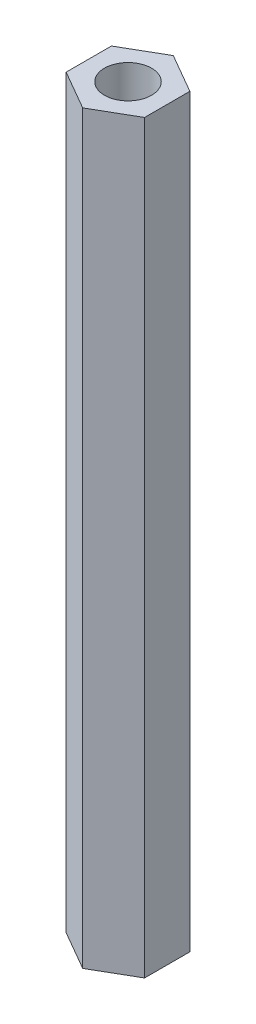
ISO-10303-21;
HEADER;
FILE_DESCRIPTION(('STEP AP214'),'2;1');
FILE_NAME('part.step','',(''),(''),'','','');
FILE_SCHEMA(('AUTOMOTIVE_DESIGN { 1 0 10303 214 1 1 1 1 }'));
ENDSEC;
DATA;
#1=APPLICATION_CONTEXT('core data for automotive mechanical design processes');
#2=APPLICATION_PROTOCOL_DEFINITION('international standard','automotive_design',2000,#1);
#3=PRODUCT_CONTEXT('',#1,'mechanical');
#4=PRODUCT('Part','Part','',(#3));
#5=PRODUCT_RELATED_PRODUCT_CATEGORY('part','',(#4));
#6=PRODUCT_DEFINITION_FORMATION('','',#4);
#7=PRODUCT_DEFINITION_CONTEXT('part definition',#1,'design');
#8=PRODUCT_DEFINITION('design','',#6,#7);
#9=PRODUCT_DEFINITION_SHAPE('','',#8);
#10=(LENGTH_UNIT() NAMED_UNIT(*) SI_UNIT(.MILLI.,.METRE.));
#11=(NAMED_UNIT(*) PLANE_ANGLE_UNIT() SI_UNIT($,.RADIAN.));
#12=(NAMED_UNIT(*) SI_UNIT($,.STERADIAN.) SOLID_ANGLE_UNIT());
#13=UNCERTAINTY_MEASURE_WITH_UNIT(LENGTH_MEASURE(1.E-05),#10,'distance_accuracy_value','');
#14=(GEOMETRIC_REPRESENTATION_CONTEXT(3) GLOBAL_UNCERTAINTY_ASSIGNED_CONTEXT((#13)) GLOBAL_UNIT_ASSIGNED_CONTEXT((#10,
#11,#12)) REPRESENTATION_CONTEXT('',''));
#15=CARTESIAN_POINT('',(0.,0.,0.));
#16=DIRECTION('',(0.,0.,1.));
#17=DIRECTION('',(1.,0.,0.));
#18=AXIS2_PLACEMENT_3D('',#15,#16,#17);
#19=CARTESIAN_POINT('',(0.,47.5,0.));
#20=DIRECTION('',(0.,1.,0.));
#21=DIRECTION('',(0.,0.,1.));
#22=AXIS2_PLACEMENT_3D('',#19,#20,#21);
#23=PLANE('',#22);
#24=DIRECTION('',(0.866025403784442,0.,0.499999999999995));
#25=VECTOR('',#24,1.);
#26=CARTESIAN_POINT('',(-2.49999999999999,47.5,1.44337567297409));
#27=LINE('',#26,#25);
#28=CARTESIAN_POINT('',(-2.49999999999999,47.5,1.44337567297409));
#29=VERTEX_POINT('',#28);
#30=CARTESIAN_POINT('',(0.,47.5,2.88675134594813));
#31=VERTEX_POINT('',#30);
#32=EDGE_CURVE('E131',#29,#31,#27,.T.);
#33=ORIENTED_EDGE('',*,*,#32,.T.);
#34=DIRECTION('',(0.866025403784438,0.,-0.500000000000001));
#35=VECTOR('',#34,1.);
#36=CARTESIAN_POINT('',(0.,47.5,2.88675134594813));
#37=LINE('',#36,#35);
#38=CARTESIAN_POINT('',(2.50000000000001,47.5,1.44337567297406));
#39=VERTEX_POINT('',#38);
#40=EDGE_CURVE('E89',#31,#39,#37,.T.);
#41=ORIENTED_EDGE('',*,*,#40,.T.);
#42=DIRECTION('',(0.,0.,-1.));
#43=VECTOR('',#42,1.);
#44=CARTESIAN_POINT('',(2.50000000000001,47.5,1.44337567297406));
#45=LINE('',#44,#43);
#46=CARTESIAN_POINT('',(2.5,47.5,-1.44337567297408));
#47=VERTEX_POINT('',#46);
#48=EDGE_CURVE('E102',#39,#47,#45,.T.);
#49=ORIENTED_EDGE('',*,*,#48,.T.);
#50=DIRECTION('',(-0.866025403784441,0.,-0.499999999999995));
#51=VECTOR('',#50,1.);
#52=CARTESIAN_POINT('',(2.5,47.5,-1.44337567297408));
#53=LINE('',#52,#51);
#54=CARTESIAN_POINT('',(0.,47.5,-2.88675134594813));
#55=VERTEX_POINT('',#54);
#56=EDGE_CURVE('E96',#47,#55,#53,.T.);
#57=ORIENTED_EDGE('',*,*,#56,.T.);
#58=DIRECTION('',(-0.866025403784435,0.,0.500000000000007));
#59=VECTOR('',#58,1.);
#60=CARTESIAN_POINT('',(0.,47.5,-2.88675134594813));
#61=LINE('',#60,#59);
#62=CARTESIAN_POINT('',(-2.50000000000002,47.5,-1.44337567297404));
#63=VERTEX_POINT('',#62);
#64=EDGE_CURVE('E100',#55,#63,#61,.T.);
#65=ORIENTED_EDGE('',*,*,#64,.T.);
#66=DIRECTION('',(0.,0.,1.));
#67=VECTOR('',#66,1.);
#68=CARTESIAN_POINT('',(-2.50000000000002,47.5,-1.44337567297404));
#69=LINE('',#68,#67);
#70=EDGE_CURVE('E52',#63,#29,#69,.T.);
#71=ORIENTED_EDGE('',*,*,#70,.T.);
#72=EDGE_LOOP('',(#33,#41,#49,#57,#65,#71));
#73=FACE_BOUND('',#72,.T.);
#74=CARTESIAN_POINT('',(0.,47.5,0.));
#75=DIRECTION('',(0.,1.,0.));
#76=DIRECTION('',(0.,0.,1.));
#77=AXIS2_PLACEMENT_3D('',#74,#75,#76);
#78=CIRCLE('',#77,1.5);
#79=CARTESIAN_POINT('',(0.,47.5,1.5));
#80=VERTEX_POINT('',#79);
#81=EDGE_CURVE('E124',#80,#80,#78,.T.);
#82=ORIENTED_EDGE('',*,*,#81,.F.);
#83=EDGE_LOOP('',(#82));
#84=FACE_BOUND('',#83,.T.);
#85=ADVANCED_FACE('F35',(#73,#84),#23,.T.);
#86=CARTESIAN_POINT('',(0.,0.,0.));
#87=DIRECTION('',(0.,1.,0.));
#88=DIRECTION('',(0.,0.,1.));
#89=AXIS2_PLACEMENT_3D('',#86,#87,#88);
#90=PLANE('',#89);
#91=DIRECTION('',(0.866025403784442,0.,0.499999999999995));
#92=VECTOR('',#91,1.);
#93=CARTESIAN_POINT('',(-2.49999999999999,0.,1.44337567297409));
#94=LINE('',#93,#92);
#95=CARTESIAN_POINT('',(-2.49999999999999,0.,1.44337567297409));
#96=VERTEX_POINT('',#95);
#97=CARTESIAN_POINT('',(0.,0.,2.88675134594813));
#98=VERTEX_POINT('',#97);
#99=EDGE_CURVE('E120',#96,#98,#94,.T.);
#100=ORIENTED_EDGE('',*,*,#99,.F.);
#101=DIRECTION('',(0.,0.,1.));
#102=VECTOR('',#101,1.);
#103=CARTESIAN_POINT('',(-2.50000000000002,0.,-1.44337567297404));
#104=LINE('',#103,#102);
#105=CARTESIAN_POINT('',(-2.50000000000002,0.,-1.44337567297404));
#106=VERTEX_POINT('',#105);
#107=EDGE_CURVE('E81',#106,#96,#104,.T.);
#108=ORIENTED_EDGE('',*,*,#107,.F.);
#109=DIRECTION('',(-0.866025403784435,0.,0.500000000000007));
#110=VECTOR('',#109,1.);
#111=CARTESIAN_POINT('',(0.,0.,-2.88675134594813));
#112=LINE('',#111,#110);
#113=CARTESIAN_POINT('',(0.,0.,-2.88675134594813));
#114=VERTEX_POINT('',#113);
#115=EDGE_CURVE('E75',#114,#106,#112,.T.);
#116=ORIENTED_EDGE('',*,*,#115,.F.);
#117=DIRECTION('',(-0.866025403784441,0.,-0.499999999999995));
#118=VECTOR('',#117,1.);
#119=CARTESIAN_POINT('',(2.5,0.,-1.44337567297408));
#120=LINE('',#119,#118);
#121=CARTESIAN_POINT('',(2.5,0.,-1.44337567297408));
#122=VERTEX_POINT('',#121);
#123=EDGE_CURVE('E110',#122,#114,#120,.T.);
#124=ORIENTED_EDGE('',*,*,#123,.F.);
#125=DIRECTION('',(0.,0.,-1.));
#126=VECTOR('',#125,1.);
#127=CARTESIAN_POINT('',(2.50000000000001,0.,1.44337567297406));
#128=LINE('',#127,#126);
#129=CARTESIAN_POINT('',(2.50000000000001,0.,1.44337567297406));
#130=VERTEX_POINT('',#129);
#131=EDGE_CURVE('E126',#130,#122,#128,.T.);
#132=ORIENTED_EDGE('',*,*,#131,.F.);
#133=DIRECTION('',(0.866025403784438,0.,-0.500000000000001));
#134=VECTOR('',#133,1.);
#135=CARTESIAN_POINT('',(0.,0.,2.88675134594813));
#136=LINE('',#135,#134);
#137=EDGE_CURVE('E123',#98,#130,#136,.T.);
#138=ORIENTED_EDGE('',*,*,#137,.F.);
#139=EDGE_LOOP('',(#100,#108,#116,#124,#132,#138));
#140=FACE_BOUND('',#139,.T.);
#141=CARTESIAN_POINT('',(0.,0.,0.));
#142=DIRECTION('',(0.,1.,0.));
#143=DIRECTION('',(0.,0.,1.));
#144=AXIS2_PLACEMENT_3D('',#141,#142,#143);
#145=CIRCLE('',#144,1.5);
#146=CARTESIAN_POINT('',(0.,0.,1.5));
#147=VERTEX_POINT('',#146);
#148=EDGE_CURVE('E224',#147,#147,#145,.T.);
#149=ORIENTED_EDGE('',*,*,#148,.T.);
#150=EDGE_LOOP('',(#149));
#151=FACE_BOUND('',#150,.T.);
#152=ADVANCED_FACE('F140',(#140,#151),#90,.F.);
#153=CARTESIAN_POINT('',(-2.49999999999999,47.5,1.44337567297409));
#154=DIRECTION('',(0.499999999999995,0.,-0.866025403784442));
#155=DIRECTION('',(-0.866025403784442,0.,-0.499999999999995));
#156=AXIS2_PLACEMENT_3D('',#153,#154,#155);
#157=PLANE('',#156);
#158=ORIENTED_EDGE('',*,*,#99,.T.);
#159=DIRECTION('',(0.,-1.,0.));
#160=VECTOR('',#159,1.);
#161=CARTESIAN_POINT('',(0.,47.5,2.88675134594813));
#162=LINE('',#161,#160);
#163=EDGE_CURVE('E11',#31,#98,#162,.T.);
#164=ORIENTED_EDGE('',*,*,#163,.F.);
#165=ORIENTED_EDGE('',*,*,#32,.F.);
#166=DIRECTION('',(0.,-1.,0.));
#167=VECTOR('',#166,1.);
#168=CARTESIAN_POINT('',(-2.49999999999999,47.5,1.44337567297409));
#169=LINE('',#168,#167);
#170=EDGE_CURVE('E116',#29,#96,#169,.T.);
#171=ORIENTED_EDGE('',*,*,#170,.T.);
#172=EDGE_LOOP('',(#158,#164,#165,#171));
#173=FACE_BOUND('',#172,.T.);
#174=ADVANCED_FACE('F37',(#173),#157,.F.);
#175=CARTESIAN_POINT('',(0.,47.5,2.88675134594813));
#176=DIRECTION('',(-0.500000000000001,0.,-0.866025403784438));
#177=DIRECTION('',(-0.866025403784438,0.,0.500000000000001));
#178=AXIS2_PLACEMENT_3D('',#175,#176,#177);
#179=PLANE('',#178);
#180=ORIENTED_EDGE('',*,*,#137,.T.);
#181=DIRECTION('',(0.,-1.,0.));
#182=VECTOR('',#181,1.);
#183=CARTESIAN_POINT('',(2.50000000000001,47.5,1.44337567297406));
#184=LINE('',#183,#182);
#185=EDGE_CURVE('E44',#39,#130,#184,.T.);
#186=ORIENTED_EDGE('',*,*,#185,.F.);
#187=ORIENTED_EDGE('',*,*,#40,.F.);
#188=ORIENTED_EDGE('',*,*,#163,.T.);
#189=EDGE_LOOP('',(#180,#186,#187,#188));
#190=FACE_BOUND('',#189,.T.);
#191=ADVANCED_FACE('F165',(#190),#179,.F.);
#192=CARTESIAN_POINT('',(2.50000000000001,47.5,1.44337567297406));
#193=DIRECTION('',(-1.,0.,0.));
#194=DIRECTION('',(0.,0.,1.));
#195=AXIS2_PLACEMENT_3D('',#192,#193,#194);
#196=PLANE('',#195);
#197=ORIENTED_EDGE('',*,*,#131,.T.);
#198=DIRECTION('',(0.,-1.,0.));
#199=VECTOR('',#198,1.);
#200=CARTESIAN_POINT('',(2.5,47.5,-1.44337567297408));
#201=LINE('',#200,#199);
#202=EDGE_CURVE('E111',#47,#122,#201,.T.);
#203=ORIENTED_EDGE('',*,*,#202,.F.);
#204=ORIENTED_EDGE('',*,*,#48,.F.);
#205=ORIENTED_EDGE('',*,*,#185,.T.);
#206=EDGE_LOOP('',(#197,#203,#204,#205));
#207=FACE_BOUND('',#206,.T.);
#208=ADVANCED_FACE('F137',(#207),#196,.F.);
#209=CARTESIAN_POINT('',(2.5,47.5,-1.44337567297408));
#210=DIRECTION('',(-0.499999999999995,0.,0.866025403784441));
#211=DIRECTION('',(0.866025403784442,0.,0.499999999999995));
#212=AXIS2_PLACEMENT_3D('',#209,#210,#211);
#213=PLANE('',#212);
#214=ORIENTED_EDGE('',*,*,#123,.T.);
#215=DIRECTION('',(0.,-1.,0.));
#216=VECTOR('',#215,1.);
#217=CARTESIAN_POINT('',(0.,47.5,-2.88675134594813));
#218=LINE('',#217,#216);
#219=EDGE_CURVE('E107',#55,#114,#218,.T.);
#220=ORIENTED_EDGE('',*,*,#219,.F.);
#221=ORIENTED_EDGE('',*,*,#56,.F.);
#222=ORIENTED_EDGE('',*,*,#202,.T.);
#223=EDGE_LOOP('',(#214,#220,#221,#222));
#224=FACE_BOUND('',#223,.T.);
#225=ADVANCED_FACE('F108',(#224),#213,.F.);
#226=CARTESIAN_POINT('',(0.,47.5,-2.88675134594813));
#227=DIRECTION('',(0.500000000000007,0.,0.866025403784435));
#228=DIRECTION('',(0.866025403784435,0.,-0.500000000000007));
#229=AXIS2_PLACEMENT_3D('',#226,#227,#228);
#230=PLANE('',#229);
#231=ORIENTED_EDGE('',*,*,#115,.T.);
#232=DIRECTION('',(0.,-1.,0.));
#233=VECTOR('',#232,1.);
#234=CARTESIAN_POINT('',(-2.50000000000002,47.5,-1.44337567297404));
#235=LINE('',#234,#233);
#236=EDGE_CURVE('E112',#63,#106,#235,.T.);
#237=ORIENTED_EDGE('',*,*,#236,.F.);
#238=ORIENTED_EDGE('',*,*,#64,.F.);
#239=ORIENTED_EDGE('',*,*,#219,.T.);
#240=EDGE_LOOP('',(#231,#237,#238,#239));
#241=FACE_BOUND('',#240,.T.);
#242=ADVANCED_FACE('F114',(#241),#230,.F.);
#243=CARTESIAN_POINT('',(-2.50000000000002,47.5,-1.44337567297404));
#244=DIRECTION('',(1.,0.,0.));
#245=DIRECTION('',(0.,0.,-1.));
#246=AXIS2_PLACEMENT_3D('',#243,#244,#245);
#247=PLANE('',#246);
#248=ORIENTED_EDGE('',*,*,#107,.T.);
#249=ORIENTED_EDGE('',*,*,#170,.F.);
#250=ORIENTED_EDGE('',*,*,#70,.F.);
#251=ORIENTED_EDGE('',*,*,#236,.T.);
#252=EDGE_LOOP('',(#248,#249,#250,#251));
#253=FACE_BOUND('',#252,.T.);
#254=ADVANCED_FACE('F145',(#253),#247,.F.);
#255=CARTESIAN_POINT('',(0.,47.5,0.));
#256=DIRECTION('',(0.,-1.,0.));
#257=DIRECTION('',(0.,0.,-1.));
#258=AXIS2_PLACEMENT_3D('',#255,#256,#257);
#259=CYLINDRICAL_SURFACE('',#258,1.5);
#260=ORIENTED_EDGE('',*,*,#81,.T.);
#261=EDGE_LOOP('',(#260));
#262=FACE_BOUND('',#261,.T.);
#263=ORIENTED_EDGE('',*,*,#148,.F.);
#264=EDGE_LOOP('',(#263));
#265=FACE_BOUND('',#264,.T.);
#266=ADVANCED_FACE('F147',(#262,#265),#259,.F.);
#267=CLOSED_SHELL('',(#85,#152,#174,#191,#208,#225,#242,#254,#266));
#268=MANIFOLD_SOLID_BREP('B2',#267);
#269=ADVANCED_BREP_SHAPE_REPRESENTATION('',(#18,#268),#14);
#270=SHAPE_DEFINITION_REPRESENTATION(#9,#269);
ENDSEC;
END-ISO-10303-21;
